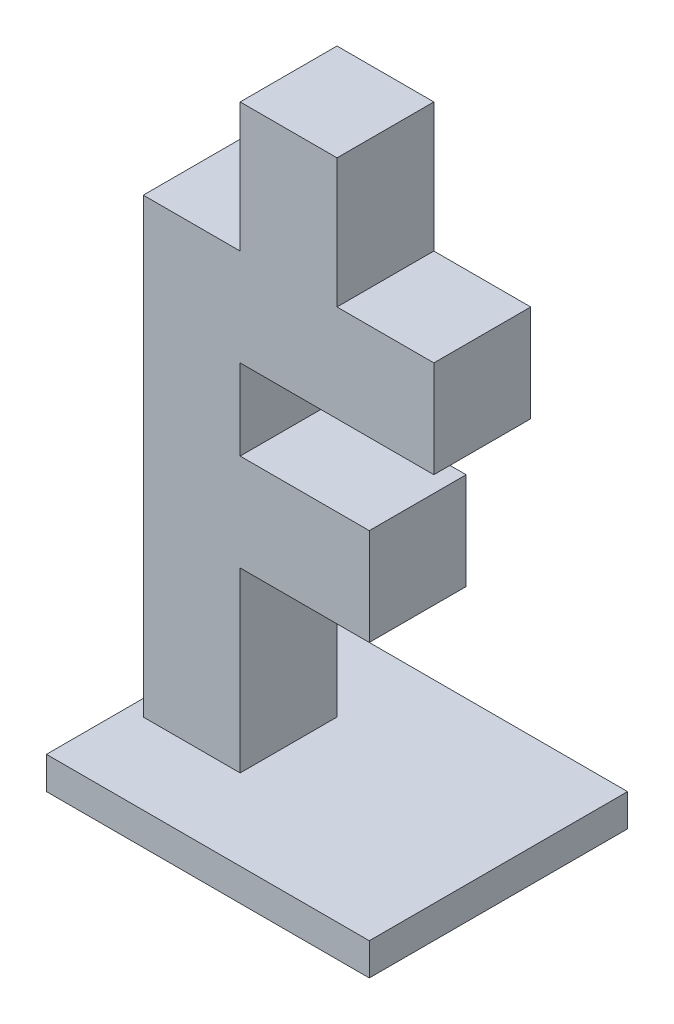
ISO-10303-21;
HEADER;
FILE_DESCRIPTION(('STEP AP214'),'2;1');
FILE_NAME('part.step','',(''),(''),'','','');
FILE_SCHEMA(('AUTOMOTIVE_DESIGN { 1 0 10303 214 1 1 1 1 }'));
ENDSEC;
DATA;
#1=APPLICATION_CONTEXT('core data for automotive mechanical design processes');
#2=APPLICATION_PROTOCOL_DEFINITION('international standard','automotive_design',2000,#1);
#3=PRODUCT_CONTEXT('',#1,'mechanical');
#4=PRODUCT('Part','Part','',(#3));
#5=PRODUCT_RELATED_PRODUCT_CATEGORY('part','',(#4));
#6=PRODUCT_DEFINITION_FORMATION('','',#4);
#7=PRODUCT_DEFINITION_CONTEXT('part definition',#1,'design');
#8=PRODUCT_DEFINITION('design','',#6,#7);
#9=PRODUCT_DEFINITION_SHAPE('','',#8);
#10=(LENGTH_UNIT() NAMED_UNIT(*) SI_UNIT(.MILLI.,.METRE.));
#11=(NAMED_UNIT(*) PLANE_ANGLE_UNIT() SI_UNIT($,.RADIAN.));
#12=(NAMED_UNIT(*) SI_UNIT($,.STERADIAN.) SOLID_ANGLE_UNIT());
#13=UNCERTAINTY_MEASURE_WITH_UNIT(LENGTH_MEASURE(1.E-05),#10,'distance_accuracy_value','');
#14=(GEOMETRIC_REPRESENTATION_CONTEXT(3) GLOBAL_UNCERTAINTY_ASSIGNED_CONTEXT((#13)) GLOBAL_UNIT_ASSIGNED_CONTEXT((#10,
#11,#12)) REPRESENTATION_CONTEXT('',''));
#15=CARTESIAN_POINT('',(0.,0.,0.));
#16=DIRECTION('',(0.,0.,1.));
#17=DIRECTION('',(1.,0.,0.));
#18=AXIS2_PLACEMENT_3D('',#15,#16,#17);
#19=CARTESIAN_POINT('',(15.,27.5,15.));
#20=DIRECTION('',(-1.,0.,0.));
#21=DIRECTION('',(0.,-1.,0.));
#22=AXIS2_PLACEMENT_3D('',#19,#20,#21);
#23=PLANE('',#22);
#24=DIRECTION('',(0.,1.,0.));
#25=VECTOR('',#24,1.);
#26=CARTESIAN_POINT('',(15.,27.5,0.));
#27=LINE('',#26,#25);
#28=CARTESIAN_POINT('',(15.,0.,0.));
#29=VERTEX_POINT('',#28);
#30=CARTESIAN_POINT('',(15.,27.5,0.));
#31=VERTEX_POINT('',#30);
#32=EDGE_CURVE('E176',#29,#31,#27,.T.);
#33=ORIENTED_EDGE('',*,*,#32,.T.);
#34=DIRECTION('',(0.,0.,-1.));
#35=VECTOR('',#34,1.);
#36=CARTESIAN_POINT('',(15.,27.5,15.));
#37=LINE('',#36,#35);
#38=CARTESIAN_POINT('',(15.,27.5,15.));
#39=VERTEX_POINT('',#38);
#40=EDGE_CURVE('E48',#39,#31,#37,.T.);
#41=ORIENTED_EDGE('',*,*,#40,.F.);
#42=DIRECTION('',(0.,1.,0.));
#43=VECTOR('',#42,1.);
#44=CARTESIAN_POINT('',(15.,27.5,15.));
#45=LINE('',#44,#43);
#46=CARTESIAN_POINT('',(15.,0.,15.));
#47=VERTEX_POINT('',#46);
#48=EDGE_CURVE('E116',#47,#39,#45,.T.);
#49=ORIENTED_EDGE('',*,*,#48,.F.);
#50=DIRECTION('',(0.,0.,-1.));
#51=VECTOR('',#50,1.);
#52=CARTESIAN_POINT('',(15.,0.,15.));
#53=LINE('',#52,#51);
#54=EDGE_CURVE('E11',#47,#29,#53,.T.);
#55=ORIENTED_EDGE('',*,*,#54,.T.);
#56=EDGE_LOOP('',(#33,#41,#49,#55));
#57=FACE_BOUND('',#56,.T.);
#58=ADVANCED_FACE('F39',(#57),#23,.F.);
#59=CARTESIAN_POINT('',(35.,27.5,15.));
#60=DIRECTION('',(0.,1.,0.));
#61=DIRECTION('',(0.,0.,1.));
#62=AXIS2_PLACEMENT_3D('',#59,#60,#61);
#63=PLANE('',#62);
#64=DIRECTION('',(1.,0.,0.));
#65=VECTOR('',#64,1.);
#66=CARTESIAN_POINT('',(35.,27.5,0.));
#67=LINE('',#66,#65);
#68=CARTESIAN_POINT('',(35.,27.5,0.));
#69=VERTEX_POINT('',#68);
#70=EDGE_CURVE('E180',#31,#69,#67,.T.);
#71=ORIENTED_EDGE('',*,*,#70,.T.);
#72=DIRECTION('',(0.,0.,-1.));
#73=VECTOR('',#72,1.);
#74=CARTESIAN_POINT('',(35.,27.5,15.));
#75=LINE('',#74,#73);
#76=CARTESIAN_POINT('',(35.,27.5,15.));
#77=VERTEX_POINT('',#76);
#78=EDGE_CURVE('E251',#77,#69,#75,.T.);
#79=ORIENTED_EDGE('',*,*,#78,.F.);
#80=DIRECTION('',(1.,0.,0.));
#81=VECTOR('',#80,1.);
#82=CARTESIAN_POINT('',(35.,27.5,15.));
#83=LINE('',#82,#81);
#84=EDGE_CURVE('E261',#39,#77,#83,.T.);
#85=ORIENTED_EDGE('',*,*,#84,.F.);
#86=ORIENTED_EDGE('',*,*,#40,.T.);
#87=EDGE_LOOP('',(#71,#79,#85,#86));
#88=FACE_BOUND('',#87,.T.);
#89=ADVANCED_FACE('F259',(#88),#63,.F.);
#90=CARTESIAN_POINT('',(35.,42.5,15.));
#91=DIRECTION('',(-1.,0.,0.));
#92=DIRECTION('',(0.,0.,1.));
#93=AXIS2_PLACEMENT_3D('',#90,#91,#92);
#94=PLANE('',#93);
#95=DIRECTION('',(0.,1.,0.));
#96=VECTOR('',#95,1.);
#97=CARTESIAN_POINT('',(35.,42.5,0.));
#98=LINE('',#97,#96);
#99=CARTESIAN_POINT('',(35.,42.5,0.));
#100=VERTEX_POINT('',#99);
#101=EDGE_CURVE('E183',#69,#100,#98,.T.);
#102=ORIENTED_EDGE('',*,*,#101,.T.);
#103=DIRECTION('',(0.,0.,-1.));
#104=VECTOR('',#103,1.);
#105=CARTESIAN_POINT('',(35.,42.5,15.));
#106=LINE('',#105,#104);
#107=CARTESIAN_POINT('',(35.,42.5,15.));
#108=VERTEX_POINT('',#107);
#109=EDGE_CURVE('E247',#108,#100,#106,.T.);
#110=ORIENTED_EDGE('',*,*,#109,.F.);
#111=DIRECTION('',(0.,1.,0.));
#112=VECTOR('',#111,1.);
#113=CARTESIAN_POINT('',(35.,42.5,15.));
#114=LINE('',#113,#112);
#115=EDGE_CURVE('E280',#77,#108,#114,.T.);
#116=ORIENTED_EDGE('',*,*,#115,.F.);
#117=ORIENTED_EDGE('',*,*,#78,.T.);
#118=EDGE_LOOP('',(#102,#110,#116,#117));
#119=FACE_BOUND('',#118,.T.);
#120=ADVANCED_FACE('F270',(#119),#94,.F.);
#121=CARTESIAN_POINT('',(15.,42.5,15.));
#122=DIRECTION('',(0.,-1.,0.));
#123=DIRECTION('',(0.,0.,-1.));
#124=AXIS2_PLACEMENT_3D('',#121,#122,#123);
#125=PLANE('',#124);
#126=DIRECTION('',(-1.,0.,0.));
#127=VECTOR('',#126,1.);
#128=CARTESIAN_POINT('',(15.,42.5,0.));
#129=LINE('',#128,#127);
#130=CARTESIAN_POINT('',(15.,42.5,0.));
#131=VERTEX_POINT('',#130);
#132=EDGE_CURVE('E186',#100,#131,#129,.T.);
#133=ORIENTED_EDGE('',*,*,#132,.T.);
#134=DIRECTION('',(0.,0.,-1.));
#135=VECTOR('',#134,1.);
#136=CARTESIAN_POINT('',(15.,42.5,15.));
#137=LINE('',#136,#135);
#138=CARTESIAN_POINT('',(15.,42.5,15.));
#139=VERTEX_POINT('',#138);
#140=EDGE_CURVE('E243',#139,#131,#137,.T.);
#141=ORIENTED_EDGE('',*,*,#140,.F.);
#142=DIRECTION('',(-1.,0.,0.));
#143=VECTOR('',#142,1.);
#144=CARTESIAN_POINT('',(15.,42.5,15.));
#145=LINE('',#144,#143);
#146=EDGE_CURVE('E276',#108,#139,#145,.T.);
#147=ORIENTED_EDGE('',*,*,#146,.F.);
#148=ORIENTED_EDGE('',*,*,#109,.T.);
#149=EDGE_LOOP('',(#133,#141,#147,#148));
#150=FACE_BOUND('',#149,.T.);
#151=ADVANCED_FACE('F274',(#150),#125,.F.);
#152=CARTESIAN_POINT('',(15.,55.,15.));
#153=DIRECTION('',(-1.,0.,0.));
#154=DIRECTION('',(0.,-1.,0.));
#155=AXIS2_PLACEMENT_3D('',#152,#153,#154);
#156=PLANE('',#155);
#157=DIRECTION('',(0.,1.,0.));
#158=VECTOR('',#157,1.);
#159=CARTESIAN_POINT('',(15.,55.,0.));
#160=LINE('',#159,#158);
#161=CARTESIAN_POINT('',(15.,55.,0.));
#162=VERTEX_POINT('',#161);
#163=EDGE_CURVE('E189',#131,#162,#160,.T.);
#164=ORIENTED_EDGE('',*,*,#163,.T.);
#165=DIRECTION('',(0.,0.,-1.));
#166=VECTOR('',#165,1.);
#167=CARTESIAN_POINT('',(15.,55.,15.));
#168=LINE('',#167,#166);
#169=CARTESIAN_POINT('',(15.,55.,15.));
#170=VERTEX_POINT('',#169);
#171=EDGE_CURVE('E239',#170,#162,#168,.T.);
#172=ORIENTED_EDGE('',*,*,#171,.F.);
#173=DIRECTION('',(0.,1.,0.));
#174=VECTOR('',#173,1.);
#175=CARTESIAN_POINT('',(15.,55.,15.));
#176=LINE('',#175,#174);
#177=EDGE_CURVE('E279',#139,#170,#176,.T.);
#178=ORIENTED_EDGE('',*,*,#177,.F.);
#179=ORIENTED_EDGE('',*,*,#140,.T.);
#180=EDGE_LOOP('',(#164,#172,#178,#179));
#181=FACE_BOUND('',#180,.T.);
#182=ADVANCED_FACE('F423',(#181),#156,.F.);
#183=CARTESIAN_POINT('',(45.,55.,15.));
#184=DIRECTION('',(0.,1.,0.));
#185=DIRECTION('',(-1.,0.,0.));
#186=AXIS2_PLACEMENT_3D('',#183,#184,#185);
#187=PLANE('',#186);
#188=DIRECTION('',(1.,0.,0.));
#189=VECTOR('',#188,1.);
#190=CARTESIAN_POINT('',(45.,55.,0.));
#191=LINE('',#190,#189);
#192=CARTESIAN_POINT('',(45.,55.,0.));
#193=VERTEX_POINT('',#192);
#194=EDGE_CURVE('E192',#162,#193,#191,.T.);
#195=ORIENTED_EDGE('',*,*,#194,.T.);
#196=DIRECTION('',(0.,0.,-1.));
#197=VECTOR('',#196,1.);
#198=CARTESIAN_POINT('',(45.,55.,15.));
#199=LINE('',#198,#197);
#200=CARTESIAN_POINT('',(45.,55.,15.));
#201=VERTEX_POINT('',#200);
#202=EDGE_CURVE('E235',#201,#193,#199,.T.);
#203=ORIENTED_EDGE('',*,*,#202,.F.);
#204=DIRECTION('',(1.,0.,0.));
#205=VECTOR('',#204,1.);
#206=CARTESIAN_POINT('',(45.,55.,15.));
#207=LINE('',#206,#205);
#208=EDGE_CURVE('E284',#170,#201,#207,.T.);
#209=ORIENTED_EDGE('',*,*,#208,.F.);
#210=ORIENTED_EDGE('',*,*,#171,.T.);
#211=EDGE_LOOP('',(#195,#203,#209,#210));
#212=FACE_BOUND('',#211,.T.);
#213=ADVANCED_FACE('F426',(#212),#187,.F.);
#214=CARTESIAN_POINT('',(45.,70.,15.));
#215=DIRECTION('',(-1.,0.,0.));
#216=DIRECTION('',(0.,-1.,0.));
#217=AXIS2_PLACEMENT_3D('',#214,#215,#216);
#218=PLANE('',#217);
#219=DIRECTION('',(0.,1.,0.));
#220=VECTOR('',#219,1.);
#221=CARTESIAN_POINT('',(45.,70.,0.));
#222=LINE('',#221,#220);
#223=CARTESIAN_POINT('',(45.,70.,0.));
#224=VERTEX_POINT('',#223);
#225=EDGE_CURVE('E195',#193,#224,#222,.T.);
#226=ORIENTED_EDGE('',*,*,#225,.T.);
#227=DIRECTION('',(0.,0.,-1.));
#228=VECTOR('',#227,1.);
#229=CARTESIAN_POINT('',(45.,70.,15.));
#230=LINE('',#229,#228);
#231=CARTESIAN_POINT('',(45.,70.,15.));
#232=VERTEX_POINT('',#231);
#233=EDGE_CURVE('E231',#232,#224,#230,.T.);
#234=ORIENTED_EDGE('',*,*,#233,.F.);
#235=DIRECTION('',(0.,1.,0.));
#236=VECTOR('',#235,1.);
#237=CARTESIAN_POINT('',(45.,70.,15.));
#238=LINE('',#237,#236);
#239=EDGE_CURVE('E291',#201,#232,#238,.T.);
#240=ORIENTED_EDGE('',*,*,#239,.F.);
#241=ORIENTED_EDGE('',*,*,#202,.T.);
#242=EDGE_LOOP('',(#226,#234,#240,#241));
#243=FACE_BOUND('',#242,.T.);
#244=ADVANCED_FACE('F430',(#243),#218,.F.);
#245=CARTESIAN_POINT('',(30.,70.,15.));
#246=DIRECTION('',(0.,-1.,0.));
#247=DIRECTION('',(0.,0.,-1.));
#248=AXIS2_PLACEMENT_3D('',#245,#246,#247);
#249=PLANE('',#248);
#250=DIRECTION('',(-1.,0.,0.));
#251=VECTOR('',#250,1.);
#252=CARTESIAN_POINT('',(30.,70.,0.));
#253=LINE('',#252,#251);
#254=CARTESIAN_POINT('',(30.,70.,0.));
#255=VERTEX_POINT('',#254);
#256=EDGE_CURVE('E198',#224,#255,#253,.T.);
#257=ORIENTED_EDGE('',*,*,#256,.T.);
#258=DIRECTION('',(0.,0.,-1.));
#259=VECTOR('',#258,1.);
#260=CARTESIAN_POINT('',(30.,70.,15.));
#261=LINE('',#260,#259);
#262=CARTESIAN_POINT('',(30.,70.,15.));
#263=VERTEX_POINT('',#262);
#264=EDGE_CURVE('E227',#263,#255,#261,.T.);
#265=ORIENTED_EDGE('',*,*,#264,.F.);
#266=DIRECTION('',(-1.,0.,0.));
#267=VECTOR('',#266,1.);
#268=CARTESIAN_POINT('',(30.,70.,15.));
#269=LINE('',#268,#267);
#270=EDGE_CURVE('E294',#232,#263,#269,.T.);
#271=ORIENTED_EDGE('',*,*,#270,.F.);
#272=ORIENTED_EDGE('',*,*,#233,.T.);
#273=EDGE_LOOP('',(#257,#265,#271,#272));
#274=FACE_BOUND('',#273,.T.);
#275=ADVANCED_FACE('F434',(#274),#249,.F.);
#276=CARTESIAN_POINT('',(30.,90.,15.));
#277=DIRECTION('',(-1.,0.,0.));
#278=DIRECTION('',(0.,-1.,0.));
#279=AXIS2_PLACEMENT_3D('',#276,#277,#278);
#280=PLANE('',#279);
#281=DIRECTION('',(0.,1.,0.));
#282=VECTOR('',#281,1.);
#283=CARTESIAN_POINT('',(30.,90.,0.));
#284=LINE('',#283,#282);
#285=CARTESIAN_POINT('',(30.,90.,0.));
#286=VERTEX_POINT('',#285);
#287=EDGE_CURVE('E201',#255,#286,#284,.T.);
#288=ORIENTED_EDGE('',*,*,#287,.T.);
#289=DIRECTION('',(0.,0.,-1.));
#290=VECTOR('',#289,1.);
#291=CARTESIAN_POINT('',(30.,90.,15.));
#292=LINE('',#291,#290);
#293=CARTESIAN_POINT('',(30.,90.,15.));
#294=VERTEX_POINT('',#293);
#295=EDGE_CURVE('E223',#294,#286,#292,.T.);
#296=ORIENTED_EDGE('',*,*,#295,.F.);
#297=DIRECTION('',(0.,1.,0.));
#298=VECTOR('',#297,1.);
#299=CARTESIAN_POINT('',(30.,90.,15.));
#300=LINE('',#299,#298);
#301=EDGE_CURVE('E297',#263,#294,#300,.T.);
#302=ORIENTED_EDGE('',*,*,#301,.F.);
#303=ORIENTED_EDGE('',*,*,#264,.T.);
#304=EDGE_LOOP('',(#288,#296,#302,#303));
#305=FACE_BOUND('',#304,.T.);
#306=ADVANCED_FACE('F305',(#305),#280,.F.);
#307=CARTESIAN_POINT('',(15.,90.,15.));
#308=DIRECTION('',(0.,-1.,0.));
#309=DIRECTION('',(0.,0.,-1.));
#310=AXIS2_PLACEMENT_3D('',#307,#308,#309);
#311=PLANE('',#310);
#312=DIRECTION('',(-1.,0.,0.));
#313=VECTOR('',#312,1.);
#314=CARTESIAN_POINT('',(15.,90.,0.));
#315=LINE('',#314,#313);
#316=CARTESIAN_POINT('',(15.,90.,0.));
#317=VERTEX_POINT('',#316);
#318=EDGE_CURVE('E204',#286,#317,#315,.T.);
#319=ORIENTED_EDGE('',*,*,#318,.T.);
#320=DIRECTION('',(0.,0.,-1.));
#321=VECTOR('',#320,1.);
#322=CARTESIAN_POINT('',(15.,90.,15.));
#323=LINE('',#322,#321);
#324=CARTESIAN_POINT('',(15.,90.,15.));
#325=VERTEX_POINT('',#324);
#326=EDGE_CURVE('E161',#325,#317,#323,.T.);
#327=ORIENTED_EDGE('',*,*,#326,.F.);
#328=DIRECTION('',(-1.,0.,0.));
#329=VECTOR('',#328,1.);
#330=CARTESIAN_POINT('',(15.,90.,15.));
#331=LINE('',#330,#329);
#332=EDGE_CURVE('E154',#294,#325,#331,.T.);
#333=ORIENTED_EDGE('',*,*,#332,.F.);
#334=ORIENTED_EDGE('',*,*,#295,.T.);
#335=EDGE_LOOP('',(#319,#327,#333,#334));
#336=FACE_BOUND('',#335,.T.);
#337=ADVANCED_FACE('F309',(#336),#311,.F.);
#338=CARTESIAN_POINT('',(15.,90.,15.));
#339=DIRECTION('',(1.,0.,0.));
#340=DIRECTION('',(0.,1.,0.));
#341=AXIS2_PLACEMENT_3D('',#338,#339,#340);
#342=PLANE('',#341);
#343=DIRECTION('',(0.,-1.,0.));
#344=VECTOR('',#343,1.);
#345=CARTESIAN_POINT('',(15.,90.,0.));
#346=LINE('',#345,#344);
#347=CARTESIAN_POINT('',(15.,70.,0.));
#348=VERTEX_POINT('',#347);
#349=EDGE_CURVE('E101',#317,#348,#346,.T.);
#350=ORIENTED_EDGE('',*,*,#349,.T.);
#351=DIRECTION('',(0.,0.,-1.));
#352=VECTOR('',#351,1.);
#353=CARTESIAN_POINT('',(15.,70.,15.));
#354=LINE('',#353,#352);
#355=CARTESIAN_POINT('',(15.,70.,15.));
#356=VERTEX_POINT('',#355);
#357=EDGE_CURVE('E158',#356,#348,#354,.T.);
#358=ORIENTED_EDGE('',*,*,#357,.F.);
#359=DIRECTION('',(0.,-1.,0.));
#360=VECTOR('',#359,1.);
#361=CARTESIAN_POINT('',(15.,90.,15.));
#362=LINE('',#361,#360);
#363=EDGE_CURVE('E149',#325,#356,#362,.T.);
#364=ORIENTED_EDGE('',*,*,#363,.F.);
#365=ORIENTED_EDGE('',*,*,#326,.T.);
#366=EDGE_LOOP('',(#350,#358,#364,#365));
#367=FACE_BOUND('',#366,.T.);
#368=ADVANCED_FACE('F159',(#367),#342,.F.);
#369=CARTESIAN_POINT('',(0.,70.,15.));
#370=DIRECTION('',(0.,-1.,0.));
#371=DIRECTION('',(0.,0.,-1.));
#372=AXIS2_PLACEMENT_3D('',#369,#370,#371);
#373=PLANE('',#372);
#374=DIRECTION('',(-1.,0.,0.));
#375=VECTOR('',#374,1.);
#376=CARTESIAN_POINT('',(0.,70.,0.));
#377=LINE('',#376,#375);
#378=CARTESIAN_POINT('',(0.,70.,0.));
#379=VERTEX_POINT('',#378);
#380=EDGE_CURVE('E108',#348,#379,#377,.T.);
#381=ORIENTED_EDGE('',*,*,#380,.T.);
#382=DIRECTION('',(0.,0.,-1.));
#383=VECTOR('',#382,1.);
#384=CARTESIAN_POINT('',(0.,70.,15.));
#385=LINE('',#384,#383);
#386=CARTESIAN_POINT('',(0.,70.,15.));
#387=VERTEX_POINT('',#386);
#388=EDGE_CURVE('E162',#387,#379,#385,.T.);
#389=ORIENTED_EDGE('',*,*,#388,.F.);
#390=DIRECTION('',(-1.,0.,0.));
#391=VECTOR('',#390,1.);
#392=CARTESIAN_POINT('',(0.,70.,15.));
#393=LINE('',#392,#391);
#394=EDGE_CURVE('E152',#356,#387,#393,.T.);
#395=ORIENTED_EDGE('',*,*,#394,.F.);
#396=ORIENTED_EDGE('',*,*,#357,.T.);
#397=EDGE_LOOP('',(#381,#389,#395,#396));
#398=FACE_BOUND('',#397,.T.);
#399=ADVANCED_FACE('F164',(#398),#373,.F.);
#400=CARTESIAN_POINT('',(0.,0.,15.));
#401=DIRECTION('',(1.,0.,0.));
#402=DIRECTION('',(0.,0.,-1.));
#403=AXIS2_PLACEMENT_3D('',#400,#401,#402);
#404=PLANE('',#403);
#405=DIRECTION('',(0.,-1.,0.));
#406=VECTOR('',#405,1.);
#407=CARTESIAN_POINT('',(0.,0.,0.));
#408=LINE('',#407,#406);
#409=CARTESIAN_POINT('',(0.,0.,0.));
#410=VERTEX_POINT('',#409);
#411=EDGE_CURVE('E211',#379,#410,#408,.T.);
#412=ORIENTED_EDGE('',*,*,#411,.T.);
#413=DIRECTION('',(0.,0.,-1.));
#414=VECTOR('',#413,1.);
#415=CARTESIAN_POINT('',(0.,0.,15.));
#416=LINE('',#415,#414);
#417=CARTESIAN_POINT('',(0.,0.,15.));
#418=VERTEX_POINT('',#417);
#419=EDGE_CURVE('E168',#418,#410,#416,.T.);
#420=ORIENTED_EDGE('',*,*,#419,.F.);
#421=DIRECTION('',(0.,-1.,0.));
#422=VECTOR('',#421,1.);
#423=CARTESIAN_POINT('',(0.,0.,15.));
#424=LINE('',#423,#422);
#425=EDGE_CURVE('E56',#387,#418,#424,.T.);
#426=ORIENTED_EDGE('',*,*,#425,.F.);
#427=ORIENTED_EDGE('',*,*,#388,.T.);
#428=EDGE_LOOP('',(#412,#420,#426,#427));
#429=FACE_BOUND('',#428,.T.);
#430=ADVANCED_FACE('F312',(#429),#404,.F.);
#431=CARTESIAN_POINT('',(0.,0.,15.));
#432=DIRECTION('',(0.,0.,-1.));
#433=DIRECTION('',(-1.,0.,0.));
#434=AXIS2_PLACEMENT_3D('',#431,#432,#433);
#435=PLANE('',#434);
#436=DIRECTION('',(1.,0.,0.));
#437=VECTOR('',#436,1.);
#438=CARTESIAN_POINT('',(15.,0.,15.));
#439=LINE('',#438,#437);
#440=EDGE_CURVE('E215',#418,#47,#439,.T.);
#441=ORIENTED_EDGE('',*,*,#440,.T.);
#442=ORIENTED_EDGE('',*,*,#48,.T.);
#443=ORIENTED_EDGE('',*,*,#84,.T.);
#444=ORIENTED_EDGE('',*,*,#115,.T.);
#445=ORIENTED_EDGE('',*,*,#146,.T.);
#446=ORIENTED_EDGE('',*,*,#177,.T.);
#447=ORIENTED_EDGE('',*,*,#208,.T.);
#448=ORIENTED_EDGE('',*,*,#239,.T.);
#449=ORIENTED_EDGE('',*,*,#270,.T.);
#450=ORIENTED_EDGE('',*,*,#301,.T.);
#451=ORIENTED_EDGE('',*,*,#332,.T.);
#452=ORIENTED_EDGE('',*,*,#363,.T.);
#453=ORIENTED_EDGE('',*,*,#394,.T.);
#454=ORIENTED_EDGE('',*,*,#425,.T.);
#455=EDGE_LOOP('',(#441,#442,#443,#444,#445,#446,#447,#448,#449,#450,#451,#452,#453,#454));
#456=FACE_BOUND('',#455,.T.);
#457=ADVANCED_FACE('F150',(#456),#435,.F.);
#458=CARTESIAN_POINT('',(0.,0.,0.));
#459=DIRECTION('',(0.,0.,-1.));
#460=DIRECTION('',(-1.,0.,0.));
#461=AXIS2_PLACEMENT_3D('',#458,#459,#460);
#462=PLANE('',#461);
#463=DIRECTION('',(1.,0.,0.));
#464=VECTOR('',#463,1.);
#465=CARTESIAN_POINT('',(15.,0.,0.));
#466=LINE('',#465,#464);
#467=EDGE_CURVE('E172',#410,#29,#466,.T.);
#468=ORIENTED_EDGE('',*,*,#467,.F.);
#469=ORIENTED_EDGE('',*,*,#411,.F.);
#470=ORIENTED_EDGE('',*,*,#380,.F.);
#471=ORIENTED_EDGE('',*,*,#349,.F.);
#472=ORIENTED_EDGE('',*,*,#318,.F.);
#473=ORIENTED_EDGE('',*,*,#287,.F.);
#474=ORIENTED_EDGE('',*,*,#256,.F.);
#475=ORIENTED_EDGE('',*,*,#225,.F.);
#476=ORIENTED_EDGE('',*,*,#194,.F.);
#477=ORIENTED_EDGE('',*,*,#163,.F.);
#478=ORIENTED_EDGE('',*,*,#132,.F.);
#479=ORIENTED_EDGE('',*,*,#101,.F.);
#480=ORIENTED_EDGE('',*,*,#70,.F.);
#481=ORIENTED_EDGE('',*,*,#32,.F.);
#482=EDGE_LOOP('',(#468,#469,#470,#471,#472,#473,#474,#475,#476,#477,#478,#479,#480,#481));
#483=FACE_BOUND('',#482,.T.);
#484=ADVANCED_FACE('F265',(#483),#462,.T.);
#485=CARTESIAN_POINT('',(0.,0.,0.));
#486=DIRECTION('',(0.,-1.,0.));
#487=DIRECTION('',(1.,0.,0.));
#488=AXIS2_PLACEMENT_3D('',#485,#486,#487);
#489=PLANE('',#488);
#490=DIRECTION('',(0.,0.,-1.));
#491=VECTOR('',#490,1.);
#492=CARTESIAN_POINT('',(-2.49999999999999,0.,27.5));
#493=LINE('',#492,#491);
#494=CARTESIAN_POINT('',(-2.49999999999999,0.,27.5));
#495=VERTEX_POINT('',#494);
#496=CARTESIAN_POINT('',(-2.49999999999999,0.,-12.5));
#497=VERTEX_POINT('',#496);
#498=EDGE_CURVE('E353',#495,#497,#493,.T.);
#499=ORIENTED_EDGE('',*,*,#498,.F.);
#500=DIRECTION('',(-1.,0.,0.));
#501=VECTOR('',#500,1.);
#502=CARTESIAN_POINT('',(-2.49999999999999,0.,27.5));
#503=LINE('',#502,#501);
#504=CARTESIAN_POINT('',(47.5,0.,27.5));
#505=VERTEX_POINT('',#504);
#506=EDGE_CURVE('E340',#505,#495,#503,.T.);
#507=ORIENTED_EDGE('',*,*,#506,.F.);
#508=DIRECTION('',(0.,0.,1.));
#509=VECTOR('',#508,1.);
#510=CARTESIAN_POINT('',(47.5,0.,27.5));
#511=LINE('',#510,#509);
#512=CARTESIAN_POINT('',(47.5,0.,-12.5));
#513=VERTEX_POINT('',#512);
#514=EDGE_CURVE('E345',#513,#505,#511,.T.);
#515=ORIENTED_EDGE('',*,*,#514,.F.);
#516=DIRECTION('',(1.,0.,0.));
#517=VECTOR('',#516,1.);
#518=CARTESIAN_POINT('',(-2.49999999999999,0.,-12.5));
#519=LINE('',#518,#517);
#520=EDGE_CURVE('E349',#497,#513,#519,.T.);
#521=ORIENTED_EDGE('',*,*,#520,.F.);
#522=EDGE_LOOP('',(#499,#507,#515,#521));
#523=FACE_BOUND('',#522,.T.);
#524=ORIENTED_EDGE('',*,*,#419,.T.);
#525=ORIENTED_EDGE('',*,*,#467,.T.);
#526=ORIENTED_EDGE('',*,*,#54,.F.);
#527=ORIENTED_EDGE('',*,*,#440,.F.);
#528=EDGE_LOOP('',(#524,#525,#526,#527));
#529=FACE_BOUND('',#528,.T.);
#530=ADVANCED_FACE('F316',(#523,#529),#489,.F.);
#531=CARTESIAN_POINT('',(-2.49999999999999,-5.,27.5));
#532=DIRECTION('',(1.,0.,0.));
#533=DIRECTION('',(0.,1.,0.));
#534=AXIS2_PLACEMENT_3D('',#531,#532,#533);
#535=PLANE('',#534);
#536=ORIENTED_EDGE('',*,*,#498,.T.);
#537=DIRECTION('',(0.,1.,0.));
#538=VECTOR('',#537,1.);
#539=CARTESIAN_POINT('',(-2.49999999999999,-5.,-12.5));
#540=LINE('',#539,#538);
#541=CARTESIAN_POINT('',(-2.49999999999999,-5.,-12.5));
#542=VERTEX_POINT('',#541);
#543=EDGE_CURVE('E177',#542,#497,#540,.T.);
#544=ORIENTED_EDGE('',*,*,#543,.F.);
#545=DIRECTION('',(0.,0.,-1.));
#546=VECTOR('',#545,1.);
#547=CARTESIAN_POINT('',(-2.49999999999999,-5.,27.5));
#548=LINE('',#547,#546);
#549=CARTESIAN_POINT('',(-2.49999999999999,-5.,27.5));
#550=VERTEX_POINT('',#549);
#551=EDGE_CURVE('E344',#550,#542,#548,.T.);
#552=ORIENTED_EDGE('',*,*,#551,.F.);
#553=DIRECTION('',(0.,1.,0.));
#554=VECTOR('',#553,1.);
#555=CARTESIAN_POINT('',(-2.49999999999999,-5.,27.5));
#556=LINE('',#555,#554);
#557=EDGE_CURVE('E335',#550,#495,#556,.T.);
#558=ORIENTED_EDGE('',*,*,#557,.T.);
#559=EDGE_LOOP('',(#536,#544,#552,#558));
#560=FACE_BOUND('',#559,.T.);
#561=ADVANCED_FACE('F383',(#560),#535,.F.);
#562=CARTESIAN_POINT('',(-2.49999999999999,-5.,-12.5));
#563=DIRECTION('',(0.,0.,1.));
#564=DIRECTION('',(1.,0.,0.));
#565=AXIS2_PLACEMENT_3D('',#562,#563,#564);
#566=PLANE('',#565);
#567=ORIENTED_EDGE('',*,*,#520,.T.);
#568=DIRECTION('',(0.,1.,0.));
#569=VECTOR('',#568,1.);
#570=CARTESIAN_POINT('',(47.5,-5.,-12.5));
#571=LINE('',#570,#569);
#572=CARTESIAN_POINT('',(47.5,-5.,-12.5));
#573=VERTEX_POINT('',#572);
#574=EDGE_CURVE('E327',#573,#513,#571,.T.);
#575=ORIENTED_EDGE('',*,*,#574,.F.);
#576=DIRECTION('',(1.,0.,0.));
#577=VECTOR('',#576,1.);
#578=CARTESIAN_POINT('',(-2.49999999999999,-5.,-12.5));
#579=LINE('',#578,#577);
#580=EDGE_CURVE('E364',#542,#573,#579,.T.);
#581=ORIENTED_EDGE('',*,*,#580,.F.);
#582=ORIENTED_EDGE('',*,*,#543,.T.);
#583=EDGE_LOOP('',(#567,#575,#581,#582));
#584=FACE_BOUND('',#583,.T.);
#585=ADVANCED_FACE('F387',(#584),#566,.F.);
#586=CARTESIAN_POINT('',(47.5,-5.,27.5));
#587=DIRECTION('',(-1.,0.,0.));
#588=DIRECTION('',(0.,0.,1.));
#589=AXIS2_PLACEMENT_3D('',#586,#587,#588);
#590=PLANE('',#589);
#591=ORIENTED_EDGE('',*,*,#514,.T.);
#592=DIRECTION('',(0.,1.,0.));
#593=VECTOR('',#592,1.);
#594=CARTESIAN_POINT('',(47.5,-5.,27.5));
#595=LINE('',#594,#593);
#596=CARTESIAN_POINT('',(47.5,-5.,27.5));
#597=VERTEX_POINT('',#596);
#598=EDGE_CURVE('E331',#597,#505,#595,.T.);
#599=ORIENTED_EDGE('',*,*,#598,.F.);
#600=DIRECTION('',(0.,0.,1.));
#601=VECTOR('',#600,1.);
#602=CARTESIAN_POINT('',(47.5,-5.,27.5));
#603=LINE('',#602,#601);
#604=EDGE_CURVE('E360',#573,#597,#603,.T.);
#605=ORIENTED_EDGE('',*,*,#604,.F.);
#606=ORIENTED_EDGE('',*,*,#574,.T.);
#607=EDGE_LOOP('',(#591,#599,#605,#606));
#608=FACE_BOUND('',#607,.T.);
#609=ADVANCED_FACE('F453',(#608),#590,.F.);
#610=CARTESIAN_POINT('',(-2.49999999999999,-5.,27.5));
#611=DIRECTION('',(0.,0.,-1.));
#612=DIRECTION('',(-1.,0.,0.));
#613=AXIS2_PLACEMENT_3D('',#610,#611,#612);
#614=PLANE('',#613);
#615=ORIENTED_EDGE('',*,*,#506,.T.);
#616=ORIENTED_EDGE('',*,*,#557,.F.);
#617=DIRECTION('',(-1.,0.,0.));
#618=VECTOR('',#617,1.);
#619=CARTESIAN_POINT('',(-2.49999999999999,-5.,27.5));
#620=LINE('',#619,#618);
#621=EDGE_CURVE('E339',#597,#550,#620,.T.);
#622=ORIENTED_EDGE('',*,*,#621,.F.);
#623=ORIENTED_EDGE('',*,*,#598,.T.);
#624=EDGE_LOOP('',(#615,#616,#622,#623));
#625=FACE_BOUND('',#624,.T.);
#626=ADVANCED_FACE('F400',(#625),#614,.F.);
#627=CARTESIAN_POINT('',(0.,-5.,0.));
#628=DIRECTION('',(0.,-1.,0.));
#629=DIRECTION('',(1.,0.,0.));
#630=AXIS2_PLACEMENT_3D('',#627,#628,#629);
#631=PLANE('',#630);
#632=ORIENTED_EDGE('',*,*,#551,.T.);
#633=ORIENTED_EDGE('',*,*,#580,.T.);
#634=ORIENTED_EDGE('',*,*,#604,.T.);
#635=ORIENTED_EDGE('',*,*,#621,.T.);
#636=EDGE_LOOP('',(#632,#633,#634,#635));
#637=FACE_BOUND('',#636,.T.);
#638=ADVANCED_FACE('F374',(#637),#631,.T.);
#639=CLOSED_SHELL('',(#58,#89,#120,#151,#182,#213,#244,#275,#306,#337,#368,#399,#430,#457,#484,
#530,#561,#585,#609,#626,#638));
#640=MANIFOLD_SOLID_BREP('B2',#639);
#641=ADVANCED_BREP_SHAPE_REPRESENTATION('',(#18,#640),#14);
#642=SHAPE_DEFINITION_REPRESENTATION(#9,#641);
ENDSEC;
END-ISO-10303-21;
